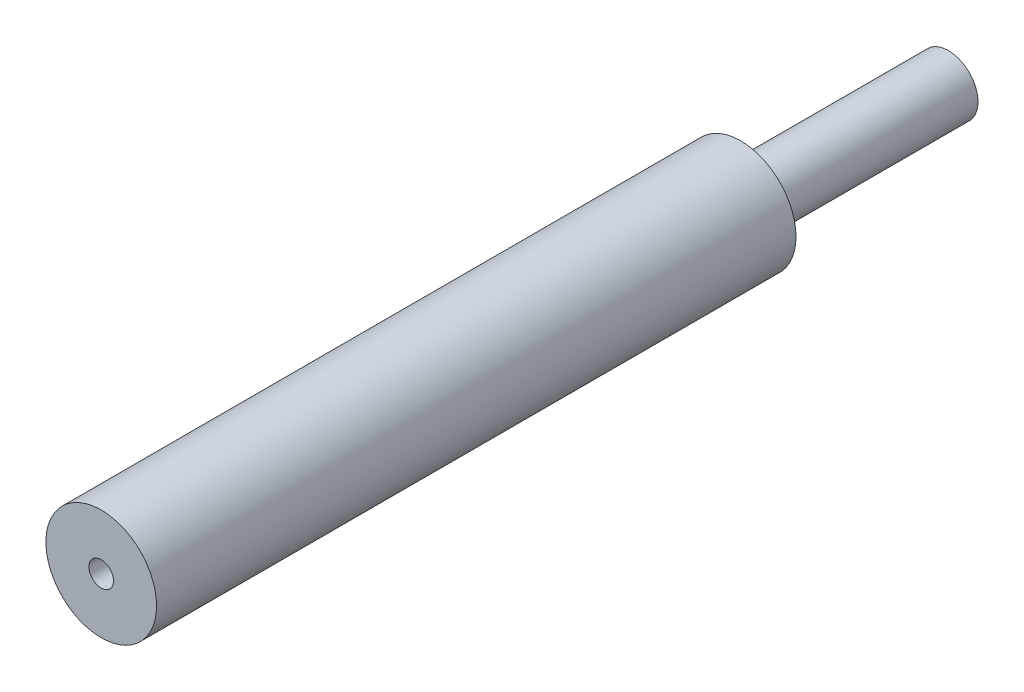
ISO-10303-21;
HEADER;
FILE_DESCRIPTION(('STEP AP214'),'2;1');
FILE_NAME('part.step','',(''),(''),'','','');
FILE_SCHEMA(('AUTOMOTIVE_DESIGN { 1 0 10303 214 1 1 1 1 }'));
ENDSEC;
DATA;
#1=APPLICATION_CONTEXT('core data for automotive mechanical design processes');
#2=APPLICATION_PROTOCOL_DEFINITION('international standard','automotive_design',2000,#1);
#3=PRODUCT_CONTEXT('',#1,'mechanical');
#4=PRODUCT('Part','Part','',(#3));
#5=PRODUCT_RELATED_PRODUCT_CATEGORY('part','',(#4));
#6=PRODUCT_DEFINITION_FORMATION('','',#4);
#7=PRODUCT_DEFINITION_CONTEXT('part definition',#1,'design');
#8=PRODUCT_DEFINITION('design','',#6,#7);
#9=PRODUCT_DEFINITION_SHAPE('','',#8);
#10=(LENGTH_UNIT() NAMED_UNIT(*) SI_UNIT(.MILLI.,.METRE.));
#11=(NAMED_UNIT(*) PLANE_ANGLE_UNIT() SI_UNIT($,.RADIAN.));
#12=(NAMED_UNIT(*) SI_UNIT($,.STERADIAN.) SOLID_ANGLE_UNIT());
#13=UNCERTAINTY_MEASURE_WITH_UNIT(LENGTH_MEASURE(1.E-05),#10,'distance_accuracy_value','');
#14=(GEOMETRIC_REPRESENTATION_CONTEXT(3) GLOBAL_UNCERTAINTY_ASSIGNED_CONTEXT((#13)) GLOBAL_UNIT_ASSIGNED_CONTEXT((#10,
#11,#12)) REPRESENTATION_CONTEXT('',''));
#15=CARTESIAN_POINT('',(0.,0.,0.));
#16=DIRECTION('',(0.,0.,1.));
#17=DIRECTION('',(1.,0.,0.));
#18=AXIS2_PLACEMENT_3D('',#15,#16,#17);
#19=CARTESIAN_POINT('',(0.,0.,0.));
#20=DIRECTION('',(0.,0.,1.));
#21=DIRECTION('',(1.,0.,0.));
#22=AXIS2_PLACEMENT_3D('',#19,#20,#21);
#23=PLANE('',#22);
#24=CARTESIAN_POINT('',(0.,0.,0.));
#25=DIRECTION('',(0.,0.,1.));
#26=DIRECTION('',(1.,0.,0.));
#27=AXIS2_PLACEMENT_3D('',#24,#25,#26);
#28=CIRCLE('',#27,1.2);
#29=CARTESIAN_POINT('',(1.2,0.,0.));
#30=VERTEX_POINT('',#29);
#31=EDGE_CURVE('E38',#30,#30,#28,.T.);
#32=ORIENTED_EDGE('',*,*,#31,.F.);
#33=EDGE_LOOP('',(#32));
#34=FACE_BOUND('',#33,.T.);
#35=CARTESIAN_POINT('',(0.,0.,0.));
#36=DIRECTION('',(0.,0.,1.));
#37=DIRECTION('',(1.,0.,0.));
#38=AXIS2_PLACEMENT_3D('',#35,#36,#37);
#39=CIRCLE('',#38,0.5);
#40=CARTESIAN_POINT('',(0.5,0.,0.));
#41=VERTEX_POINT('',#40);
#42=EDGE_CURVE('E48',#41,#41,#39,.T.);
#43=ORIENTED_EDGE('',*,*,#42,.T.);
#44=EDGE_LOOP('',(#43));
#45=FACE_BOUND('',#44,.T.);
#46=ADVANCED_FACE('F34',(#34,#45),#23,.F.);
#47=CARTESIAN_POINT('',(0.,0.,8.45));
#48=DIRECTION('',(0.,0.,-1.));
#49=DIRECTION('',(-1.,0.,0.));
#50=AXIS2_PLACEMENT_3D('',#47,#48,#49);
#51=CYLINDRICAL_SURFACE('',#50,1.2);
#52=CARTESIAN_POINT('',(0.,0.,8.45));
#53=DIRECTION('',(0.,0.,1.));
#54=DIRECTION('',(1.,0.,0.));
#55=AXIS2_PLACEMENT_3D('',#52,#53,#54);
#56=CIRCLE('',#55,1.2);
#57=CARTESIAN_POINT('',(1.2,0.,8.45));
#58=VERTEX_POINT('',#57);
#59=EDGE_CURVE('E10',#58,#58,#56,.T.);
#60=ORIENTED_EDGE('',*,*,#59,.F.);
#61=EDGE_LOOP('',(#60));
#62=FACE_BOUND('',#61,.T.);
#63=ORIENTED_EDGE('',*,*,#31,.T.);
#64=EDGE_LOOP('',(#63));
#65=FACE_BOUND('',#64,.T.);
#66=ADVANCED_FACE('F36',(#62,#65),#51,.T.);
#67=CARTESIAN_POINT('',(0.,0.,8.45));
#68=DIRECTION('',(0.,0.,-1.));
#69=DIRECTION('',(-1.,0.,0.));
#70=AXIS2_PLACEMENT_3D('',#67,#68,#69);
#71=CYLINDRICAL_SURFACE('',#70,0.5);
#72=ORIENTED_EDGE('',*,*,#42,.F.);
#73=EDGE_LOOP('',(#72));
#74=FACE_BOUND('',#73,.T.);
#75=CARTESIAN_POINT('',(0.,0.,34.45));
#76=DIRECTION('',(0.,0.,1.));
#77=DIRECTION('',(1.,0.,0.));
#78=AXIS2_PLACEMENT_3D('',#75,#76,#77);
#79=CIRCLE('',#78,0.5);
#80=CARTESIAN_POINT('',(0.5,0.,34.45));
#81=VERTEX_POINT('',#80);
#82=EDGE_CURVE('E58',#81,#81,#79,.T.);
#83=ORIENTED_EDGE('',*,*,#82,.T.);
#84=EDGE_LOOP('',(#83));
#85=FACE_BOUND('',#84,.T.);
#86=ADVANCED_FACE('F67',(#74,#85),#71,.F.);
#87=CARTESIAN_POINT('',(0.,0.,34.45));
#88=DIRECTION('',(0.,0.,1.));
#89=DIRECTION('',(1.,0.,0.));
#90=AXIS2_PLACEMENT_3D('',#87,#88,#89);
#91=PLANE('',#90);
#92=CARTESIAN_POINT('',(0.,0.,34.45));
#93=DIRECTION('',(0.,0.,1.));
#94=DIRECTION('',(1.,0.,0.));
#95=AXIS2_PLACEMENT_3D('',#92,#93,#94);
#96=CIRCLE('',#95,2.25);
#97=CARTESIAN_POINT('',(2.25,0.,34.45));
#98=VERTEX_POINT('',#97);
#99=EDGE_CURVE('E53',#98,#98,#96,.T.);
#100=ORIENTED_EDGE('',*,*,#99,.T.);
#101=EDGE_LOOP('',(#100));
#102=FACE_BOUND('',#101,.T.);
#103=ORIENTED_EDGE('',*,*,#82,.F.);
#104=EDGE_LOOP('',(#103));
#105=FACE_BOUND('',#104,.T.);
#106=ADVANCED_FACE('F69',(#102,#105),#91,.T.);
#107=CARTESIAN_POINT('',(0.,0.,8.45));
#108=DIRECTION('',(0.,0.,1.));
#109=DIRECTION('',(1.,0.,0.));
#110=AXIS2_PLACEMENT_3D('',#107,#108,#109);
#111=PLANE('',#110);
#112=ORIENTED_EDGE('',*,*,#59,.T.);
#113=EDGE_LOOP('',(#112));
#114=FACE_BOUND('',#113,.T.);
#115=CARTESIAN_POINT('',(0.,0.,8.45));
#116=DIRECTION('',(0.,0.,1.));
#117=DIRECTION('',(1.,0.,0.));
#118=AXIS2_PLACEMENT_3D('',#115,#116,#117);
#119=CIRCLE('',#118,2.25);
#120=CARTESIAN_POINT('',(2.25,0.,8.45));
#121=VERTEX_POINT('',#120);
#122=EDGE_CURVE('E54',#121,#121,#119,.T.);
#123=ORIENTED_EDGE('',*,*,#122,.F.);
#124=EDGE_LOOP('',(#123));
#125=FACE_BOUND('',#124,.T.);
#126=ADVANCED_FACE('F71',(#114,#125),#111,.F.);
#127=CARTESIAN_POINT('',(0.,0.,34.45));
#128=DIRECTION('',(0.,0.,-1.));
#129=DIRECTION('',(-1.,0.,0.));
#130=AXIS2_PLACEMENT_3D('',#127,#128,#129);
#131=CYLINDRICAL_SURFACE('',#130,2.25);
#132=ORIENTED_EDGE('',*,*,#99,.F.);
#133=EDGE_LOOP('',(#132));
#134=FACE_BOUND('',#133,.T.);
#135=ORIENTED_EDGE('',*,*,#122,.T.);
#136=EDGE_LOOP('',(#135));
#137=FACE_BOUND('',#136,.T.);
#138=ADVANCED_FACE('F78',(#134,#137),#131,.T.);
#139=CLOSED_SHELL('',(#46,#66,#86,#106,#126,#138));
#140=MANIFOLD_SOLID_BREP('B2',#139);
#141=ADVANCED_BREP_SHAPE_REPRESENTATION('',(#18,#140),#14);
#142=SHAPE_DEFINITION_REPRESENTATION(#9,#141);
ENDSEC;
END-ISO-10303-21;
